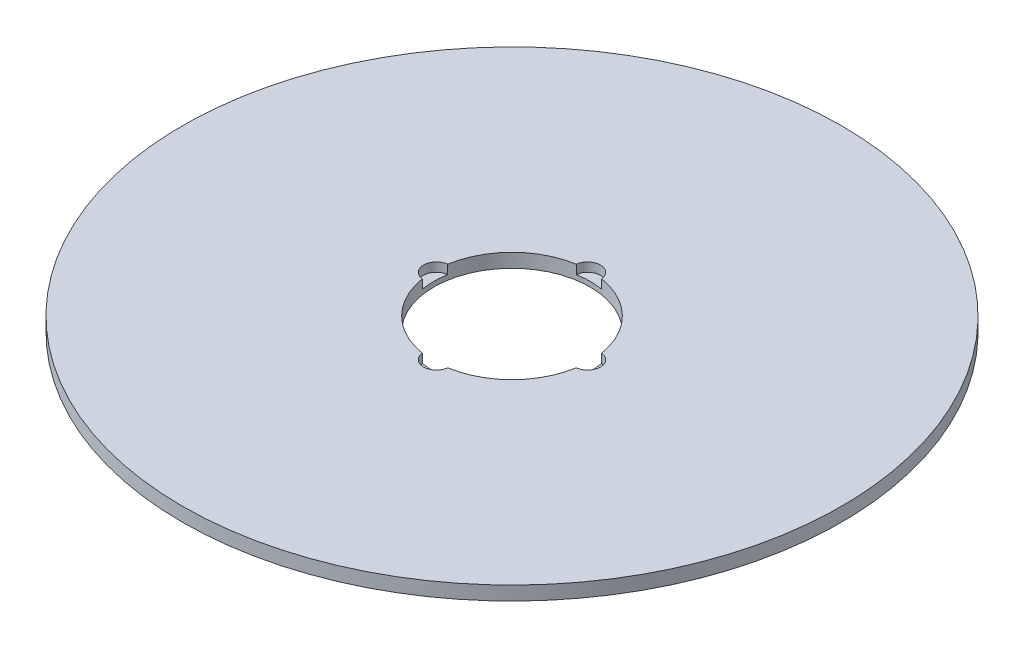
ISO-10303-21;
HEADER;
FILE_DESCRIPTION(('STEP AP214'),'2;1');
FILE_NAME('part.step','',(''),(''),'','','');
FILE_SCHEMA(('AUTOMOTIVE_DESIGN { 1 0 10303 214 1 1 1 1 }'));
ENDSEC;
DATA;
#1=APPLICATION_CONTEXT('core data for automotive mechanical design processes');
#2=APPLICATION_PROTOCOL_DEFINITION('international standard','automotive_design',2000,#1);
#3=PRODUCT_CONTEXT('',#1,'mechanical');
#4=PRODUCT('Part','Part','',(#3));
#5=PRODUCT_RELATED_PRODUCT_CATEGORY('part','',(#4));
#6=PRODUCT_DEFINITION_FORMATION('','',#4);
#7=PRODUCT_DEFINITION_CONTEXT('part definition',#1,'design');
#8=PRODUCT_DEFINITION('design','',#6,#7);
#9=PRODUCT_DEFINITION_SHAPE('','',#8);
#10=(LENGTH_UNIT() NAMED_UNIT(*) SI_UNIT(.MILLI.,.METRE.));
#11=(NAMED_UNIT(*) PLANE_ANGLE_UNIT() SI_UNIT($,.RADIAN.));
#12=(NAMED_UNIT(*) SI_UNIT($,.STERADIAN.) SOLID_ANGLE_UNIT());
#13=UNCERTAINTY_MEASURE_WITH_UNIT(LENGTH_MEASURE(1.E-05),#10,'distance_accuracy_value','');
#14=(GEOMETRIC_REPRESENTATION_CONTEXT(3) GLOBAL_UNCERTAINTY_ASSIGNED_CONTEXT((#13)) GLOBAL_UNIT_ASSIGNED_CONTEXT((#10,
#11,#12)) REPRESENTATION_CONTEXT('',''));
#15=CARTESIAN_POINT('',(0.,0.,0.));
#16=DIRECTION('',(0.,0.,1.));
#17=DIRECTION('',(1.,0.,0.));
#18=AXIS2_PLACEMENT_3D('',#15,#16,#17);
#19=CARTESIAN_POINT('',(0.,4.,0.));
#20=DIRECTION('',(0.,-1.,0.));
#21=DIRECTION('',(0.,0.,-1.));
#22=AXIS2_PLACEMENT_3D('',#19,#20,#21);
#23=CYLINDRICAL_SURFACE('',#22,95.);
#24=CARTESIAN_POINT('',(0.,4.,0.));
#25=DIRECTION('',(0.,1.,0.));
#26=DIRECTION('',(0.,0.,1.));
#27=AXIS2_PLACEMENT_3D('',#24,#25,#26);
#28=CIRCLE('',#27,95.);
#29=CARTESIAN_POINT('',(0.,4.,95.));
#30=VERTEX_POINT('',#29);
#31=EDGE_CURVE('E148',#30,#30,#28,.T.);
#32=ORIENTED_EDGE('',*,*,#31,.F.);
#33=EDGE_LOOP('',(#32));
#34=FACE_BOUND('',#33,.T.);
#35=CARTESIAN_POINT('',(0.,0.,0.));
#36=DIRECTION('',(0.,1.,0.));
#37=DIRECTION('',(0.,0.,1.));
#38=AXIS2_PLACEMENT_3D('',#35,#36,#37);
#39=CIRCLE('',#38,95.);
#40=CARTESIAN_POINT('',(0.,0.,95.));
#41=VERTEX_POINT('',#40);
#42=EDGE_CURVE('E139',#41,#41,#39,.T.);
#43=ORIENTED_EDGE('',*,*,#42,.T.);
#44=EDGE_LOOP('',(#43));
#45=FACE_BOUND('',#44,.T.);
#46=ADVANCED_FACE('F39',(#34,#45),#23,.T.);
#47=CARTESIAN_POINT('',(0.,4.,0.));
#48=DIRECTION('',(0.,1.,0.));
#49=DIRECTION('',(0.,0.,1.));
#50=AXIS2_PLACEMENT_3D('',#47,#48,#49);
#51=PLANE('',#50);
#52=CARTESIAN_POINT('',(0.,4.,21.7918346081604));
#53=DIRECTION('',(0.,1.,0.));
#54=DIRECTION('',(1.,0.,0.));
#55=AXIS2_PLACEMENT_3D('',#52,#53,#54);
#56=CIRCLE('',#55,3.68968708236115);
#57=CARTESIAN_POINT('',(-3.66713616598256,4.,22.1991466579268));
#58=VERTEX_POINT('',#57);
#59=CARTESIAN_POINT('',(3.66713616598272,4.,22.1991466579268));
#60=VERTEX_POINT('',#59);
#61=EDGE_CURVE('E175',#58,#60,#56,.T.);
#62=ORIENTED_EDGE('',*,*,#61,.F.);
#63=CARTESIAN_POINT('',(0.,4.,0.));
#64=DIRECTION('',(0.,1.,0.));
#65=DIRECTION('',(0.,0.,1.));
#66=AXIS2_PLACEMENT_3D('',#63,#64,#65);
#67=CIRCLE('',#66,22.5);
#68=CARTESIAN_POINT('',(-22.1991466579268,4.,3.66713616598264));
#69=VERTEX_POINT('',#68);
#70=EDGE_CURVE('E134',#69,#58,#67,.T.);
#71=ORIENTED_EDGE('',*,*,#70,.F.);
#72=CARTESIAN_POINT('',(-21.7918346081604,4.,0.));
#73=DIRECTION('',(0.,1.,0.));
#74=DIRECTION('',(0.,0.,1.));
#75=AXIS2_PLACEMENT_3D('',#72,#73,#74);
#76=CIRCLE('',#75,3.68968708236115);
#77=CARTESIAN_POINT('',(-22.1991466579268,4.,-3.66713616598264));
#78=VERTEX_POINT('',#77);
#79=EDGE_CURVE('E143',#78,#69,#76,.T.);
#80=ORIENTED_EDGE('',*,*,#79,.F.);
#81=CARTESIAN_POINT('',(-3.66713616598287,4.,-22.1991466579268));
#82=VERTEX_POINT('',#81);
#83=EDGE_CURVE('E123',#82,#78,#67,.T.);
#84=ORIENTED_EDGE('',*,*,#83,.F.);
#85=CARTESIAN_POINT('',(-2.28257351620644E-13,4.,-21.7918346081604));
#86=DIRECTION('',(0.,1.,0.));
#87=DIRECTION('',(-1.,0.,0.));
#88=AXIS2_PLACEMENT_3D('',#85,#86,#87);
#89=CIRCLE('',#88,3.68968708236115);
#90=CARTESIAN_POINT('',(3.66713616598241,4.,-22.1991466579268));
#91=VERTEX_POINT('',#90);
#92=EDGE_CURVE('E106',#91,#82,#89,.T.);
#93=ORIENTED_EDGE('',*,*,#92,.F.);
#94=CARTESIAN_POINT('',(22.1991466579268,4.,-3.66713616598264));
#95=VERTEX_POINT('',#94);
#96=EDGE_CURVE('E125',#95,#91,#67,.T.);
#97=ORIENTED_EDGE('',*,*,#96,.F.);
#98=CARTESIAN_POINT('',(21.7918346081604,4.,0.));
#99=DIRECTION('',(0.,1.,0.));
#100=DIRECTION('',(0.,0.,-1.));
#101=AXIS2_PLACEMENT_3D('',#98,#99,#100);
#102=CIRCLE('',#101,3.68968708236115);
#103=CARTESIAN_POINT('',(22.1991466579268,4.,3.66713616598264));
#104=VERTEX_POINT('',#103);
#105=EDGE_CURVE('E286',#104,#95,#102,.T.);
#106=ORIENTED_EDGE('',*,*,#105,.F.);
#107=EDGE_CURVE('E135',#60,#104,#67,.T.);
#108=ORIENTED_EDGE('',*,*,#107,.F.);
#109=EDGE_LOOP('',(#62,#71,#80,#84,#93,#97,#106,#108));
#110=FACE_BOUND('',#109,.T.);
#111=ORIENTED_EDGE('',*,*,#31,.T.);
#112=EDGE_LOOP('',(#111));
#113=FACE_BOUND('',#112,.T.);
#114=ADVANCED_FACE('F118',(#110,#113),#51,.T.);
#115=CARTESIAN_POINT('',(0.,0.,0.));
#116=DIRECTION('',(0.,1.,0.));
#117=DIRECTION('',(0.,0.,1.));
#118=AXIS2_PLACEMENT_3D('',#115,#116,#117);
#119=PLANE('',#118);
#120=CARTESIAN_POINT('',(0.,0.,0.));
#121=DIRECTION('',(0.,1.,0.));
#122=DIRECTION('',(0.,0.,1.));
#123=AXIS2_PLACEMENT_3D('',#120,#121,#122);
#124=CIRCLE('',#123,22.5);
#125=CARTESIAN_POINT('',(0.,0.,22.5));
#126=VERTEX_POINT('',#125);
#127=EDGE_CURVE('E136',#126,#126,#124,.T.);
#128=ORIENTED_EDGE('',*,*,#127,.T.);
#129=EDGE_LOOP('',(#128));
#130=FACE_BOUND('',#129,.T.);
#131=ORIENTED_EDGE('',*,*,#42,.F.);
#132=EDGE_LOOP('',(#131));
#133=FACE_BOUND('',#132,.T.);
#134=ADVANCED_FACE('F187',(#130,#133),#119,.F.);
#135=CARTESIAN_POINT('',(0.,4.,0.));
#136=DIRECTION('',(0.,-1.,0.));
#137=DIRECTION('',(0.,0.,-1.));
#138=AXIS2_PLACEMENT_3D('',#135,#136,#137);
#139=CYLINDRICAL_SURFACE('',#138,22.5);
#140=DIRECTION('',(0.,1.,0.));
#141=VECTOR('',#140,1.);
#142=CARTESIAN_POINT('',(-3.66713616598256,2.70690522378517,22.1991466579268));
#143=LINE('',#142,#141);
#144=CARTESIAN_POINT('',(-3.66713616598256,1.41381044757035,22.1991466579268));
#145=VERTEX_POINT('',#144);
#146=EDGE_CURVE('E11',#145,#58,#143,.T.);
#147=ORIENTED_EDGE('',*,*,#146,.F.);
#148=CARTESIAN_POINT('',(0.,1.41381044757035,0.));
#149=DIRECTION('',(0.,1.,0.));
#150=DIRECTION('',(0.,0.,1.));
#151=AXIS2_PLACEMENT_3D('',#148,#149,#150);
#152=CIRCLE('',#151,22.5);
#153=CARTESIAN_POINT('',(3.66713616598272,1.41381044757035,22.1991466579268));
#154=VERTEX_POINT('',#153);
#155=EDGE_CURVE('E170',#145,#154,#152,.T.);
#156=ORIENTED_EDGE('',*,*,#155,.T.);
#157=DIRECTION('',(0.,1.,0.));
#158=VECTOR('',#157,1.);
#159=CARTESIAN_POINT('',(3.66713616598272,2.70690522378517,22.1991466579268));
#160=LINE('',#159,#158);
#161=EDGE_CURVE('E46',#60,#154,#160,.F.);
#162=ORIENTED_EDGE('',*,*,#161,.F.);
#163=ORIENTED_EDGE('',*,*,#107,.T.);
#164=DIRECTION('',(0.,1.,0.));
#165=VECTOR('',#164,1.);
#166=CARTESIAN_POINT('',(22.1991466579268,2.70690522378517,3.66713616598264));
#167=LINE('',#166,#165);
#168=CARTESIAN_POINT('',(22.1991466579268,1.41381044757035,3.66713616598264));
#169=VERTEX_POINT('',#168);
#170=EDGE_CURVE('E164',#169,#104,#167,.T.);
#171=ORIENTED_EDGE('',*,*,#170,.F.);
#172=CARTESIAN_POINT('',(0.,1.41381044757035,0.));
#173=DIRECTION('',(0.,1.,0.));
#174=DIRECTION('',(0.,0.,1.));
#175=AXIS2_PLACEMENT_3D('',#172,#173,#174);
#176=CIRCLE('',#175,22.5);
#177=CARTESIAN_POINT('',(22.1991466579268,1.41381044757035,-3.66713616598264));
#178=VERTEX_POINT('',#177);
#179=EDGE_CURVE('E115',#169,#178,#176,.T.);
#180=ORIENTED_EDGE('',*,*,#179,.T.);
#181=DIRECTION('',(0.,1.,0.));
#182=VECTOR('',#181,1.);
#183=CARTESIAN_POINT('',(22.1991466579268,2.70690522378517,-3.66713616598264));
#184=LINE('',#183,#182);
#185=EDGE_CURVE('E131',#95,#178,#184,.F.);
#186=ORIENTED_EDGE('',*,*,#185,.F.);
#187=ORIENTED_EDGE('',*,*,#96,.T.);
#188=DIRECTION('',(0.,1.,0.));
#189=VECTOR('',#188,1.);
#190=CARTESIAN_POINT('',(3.66713616598241,2.70690522378517,-22.1991466579268));
#191=LINE('',#190,#189);
#192=CARTESIAN_POINT('',(3.66713616598241,1.41381044757035,-22.1991466579268));
#193=VERTEX_POINT('',#192);
#194=EDGE_CURVE('E105',#193,#91,#191,.T.);
#195=ORIENTED_EDGE('',*,*,#194,.F.);
#196=CARTESIAN_POINT('',(0.,1.41381044757035,0.));
#197=DIRECTION('',(0.,1.,0.));
#198=DIRECTION('',(0.,0.,1.));
#199=AXIS2_PLACEMENT_3D('',#196,#197,#198);
#200=CIRCLE('',#199,22.5);
#201=CARTESIAN_POINT('',(-3.66713616598287,1.41381044757035,-22.1991466579268));
#202=VERTEX_POINT('',#201);
#203=EDGE_CURVE('E159',#193,#202,#200,.T.);
#204=ORIENTED_EDGE('',*,*,#203,.T.);
#205=DIRECTION('',(0.,1.,0.));
#206=VECTOR('',#205,1.);
#207=CARTESIAN_POINT('',(-3.66713616598287,2.70690522378517,-22.1991466579268));
#208=LINE('',#207,#206);
#209=EDGE_CURVE('E114',#82,#202,#208,.F.);
#210=ORIENTED_EDGE('',*,*,#209,.F.);
#211=ORIENTED_EDGE('',*,*,#83,.T.);
#212=DIRECTION('',(0.,1.,0.));
#213=VECTOR('',#212,1.);
#214=CARTESIAN_POINT('',(-22.1991466579268,2.70690522378517,-3.66713616598264));
#215=LINE('',#214,#213);
#216=CARTESIAN_POINT('',(-22.1991466579268,1.41381044757035,-3.66713616598264));
#217=VERTEX_POINT('',#216);
#218=EDGE_CURVE('E160',#217,#78,#215,.T.);
#219=ORIENTED_EDGE('',*,*,#218,.F.);
#220=CARTESIAN_POINT('',(0.,1.41381044757035,0.));
#221=DIRECTION('',(0.,1.,0.));
#222=DIRECTION('',(0.,0.,1.));
#223=AXIS2_PLACEMENT_3D('',#220,#221,#222);
#224=CIRCLE('',#223,22.5);
#225=CARTESIAN_POINT('',(-22.1991466579268,1.41381044757035,3.66713616598264));
#226=VERTEX_POINT('',#225);
#227=EDGE_CURVE('E149',#217,#226,#224,.T.);
#228=ORIENTED_EDGE('',*,*,#227,.T.);
#229=DIRECTION('',(0.,1.,0.));
#230=VECTOR('',#229,1.);
#231=CARTESIAN_POINT('',(-22.1991466579268,2.70690522378517,3.66713616598264));
#232=LINE('',#231,#230);
#233=EDGE_CURVE('E152',#69,#226,#232,.F.);
#234=ORIENTED_EDGE('',*,*,#233,.F.);
#235=ORIENTED_EDGE('',*,*,#70,.T.);
#236=EDGE_LOOP('',(#147,#156,#162,#163,#171,#180,#186,#187,#195,#204,#210,#211,#219,#228,#234,#235));
#237=FACE_BOUND('',#236,.T.);
#238=ORIENTED_EDGE('',*,*,#127,.F.);
#239=EDGE_LOOP('',(#238));
#240=FACE_BOUND('',#239,.T.);
#241=ADVANCED_FACE('F126',(#237,#240),#139,.F.);
#242=CARTESIAN_POINT('',(-21.7918346081604,1.41381044757035,0.));
#243=DIRECTION('',(0.,1.,0.));
#244=DIRECTION('',(0.,0.,1.));
#245=AXIS2_PLACEMENT_3D('',#242,#243,#244);
#246=CYLINDRICAL_SURFACE('',#245,3.68968708236115);
#247=ORIENTED_EDGE('',*,*,#218,.T.);
#248=ORIENTED_EDGE('',*,*,#79,.T.);
#249=ORIENTED_EDGE('',*,*,#233,.T.);
#250=CARTESIAN_POINT('',(-21.7918346081604,1.41381044757035,0.));
#251=DIRECTION('',(0.,1.,0.));
#252=DIRECTION('',(0.,0.,1.));
#253=AXIS2_PLACEMENT_3D('',#250,#251,#252);
#254=CIRCLE('',#253,3.68968708236115);
#255=EDGE_CURVE('E144',#217,#226,#254,.T.);
#256=ORIENTED_EDGE('',*,*,#255,.F.);
#257=EDGE_LOOP('',(#247,#248,#249,#256));
#258=FACE_BOUND('',#257,.T.);
#259=ADVANCED_FACE('F200',(#258),#246,.F.);
#260=CARTESIAN_POINT('',(-21.7918346081604,1.41381044757035,0.));
#261=DIRECTION('',(0.,1.,0.));
#262=DIRECTION('',(0.,0.,1.));
#263=AXIS2_PLACEMENT_3D('',#260,#261,#262);
#264=PLANE('',#263);
#265=ORIENTED_EDGE('',*,*,#255,.T.);
#266=ORIENTED_EDGE('',*,*,#227,.F.);
#267=EDGE_LOOP('',(#265,#266));
#268=FACE_BOUND('',#267,.T.);
#269=ADVANCED_FACE('F201',(#268),#264,.T.);
#270=CARTESIAN_POINT('',(-2.28257351620644E-13,1.41381044757035,-21.7918346081604));
#271=DIRECTION('',(0.,1.,0.));
#272=DIRECTION('',(0.,0.,1.));
#273=AXIS2_PLACEMENT_3D('',#270,#271,#272);
#274=CYLINDRICAL_SURFACE('',#273,3.68968708236115);
#275=ORIENTED_EDGE('',*,*,#194,.T.);
#276=ORIENTED_EDGE('',*,*,#92,.T.);
#277=ORIENTED_EDGE('',*,*,#209,.T.);
#278=CARTESIAN_POINT('',(-2.28257351620644E-13,1.41381044757035,-21.7918346081604));
#279=DIRECTION('',(0.,1.,0.));
#280=DIRECTION('',(-1.,0.,0.));
#281=AXIS2_PLACEMENT_3D('',#278,#279,#280);
#282=CIRCLE('',#281,3.68968708236115);
#283=EDGE_CURVE('E107',#193,#202,#282,.T.);
#284=ORIENTED_EDGE('',*,*,#283,.F.);
#285=EDGE_LOOP('',(#275,#276,#277,#284));
#286=FACE_BOUND('',#285,.T.);
#287=ADVANCED_FACE('F102',(#286),#274,.F.);
#288=CARTESIAN_POINT('',(-2.28257351620644E-13,1.41381044757035,-21.7918346081604));
#289=DIRECTION('',(0.,1.,0.));
#290=DIRECTION('',(-1.,0.,0.));
#291=AXIS2_PLACEMENT_3D('',#288,#289,#290);
#292=PLANE('',#291);
#293=ORIENTED_EDGE('',*,*,#283,.T.);
#294=ORIENTED_EDGE('',*,*,#203,.F.);
#295=EDGE_LOOP('',(#293,#294));
#296=FACE_BOUND('',#295,.T.);
#297=ADVANCED_FACE('F209',(#296),#292,.T.);
#298=CARTESIAN_POINT('',(21.7918346081604,1.41381044757035,0.));
#299=DIRECTION('',(0.,1.,0.));
#300=DIRECTION('',(0.,0.,1.));
#301=AXIS2_PLACEMENT_3D('',#298,#299,#300);
#302=CYLINDRICAL_SURFACE('',#301,3.68968708236115);
#303=ORIENTED_EDGE('',*,*,#170,.T.);
#304=ORIENTED_EDGE('',*,*,#105,.T.);
#305=ORIENTED_EDGE('',*,*,#185,.T.);
#306=CARTESIAN_POINT('',(21.7918346081604,1.41381044757035,0.));
#307=DIRECTION('',(0.,1.,0.));
#308=DIRECTION('',(0.,0.,-1.));
#309=AXIS2_PLACEMENT_3D('',#306,#307,#308);
#310=CIRCLE('',#309,3.68968708236115);
#311=EDGE_CURVE('E56',#169,#178,#310,.T.);
#312=ORIENTED_EDGE('',*,*,#311,.F.);
#313=EDGE_LOOP('',(#303,#304,#305,#312));
#314=FACE_BOUND('',#313,.T.);
#315=ADVANCED_FACE('F213',(#314),#302,.F.);
#316=CARTESIAN_POINT('',(21.7918346081604,1.41381044757035,0.));
#317=DIRECTION('',(0.,1.,0.));
#318=DIRECTION('',(0.,0.,-1.));
#319=AXIS2_PLACEMENT_3D('',#316,#317,#318);
#320=PLANE('',#319);
#321=ORIENTED_EDGE('',*,*,#311,.T.);
#322=ORIENTED_EDGE('',*,*,#179,.F.);
#323=EDGE_LOOP('',(#321,#322));
#324=FACE_BOUND('',#323,.T.);
#325=ADVANCED_FACE('F179',(#324),#320,.T.);
#326=CARTESIAN_POINT('',(0.,1.41381044757035,21.7918346081604));
#327=DIRECTION('',(0.,1.,0.));
#328=DIRECTION('',(0.,0.,1.));
#329=AXIS2_PLACEMENT_3D('',#326,#327,#328);
#330=CYLINDRICAL_SURFACE('',#329,3.68968708236115);
#331=ORIENTED_EDGE('',*,*,#146,.T.);
#332=ORIENTED_EDGE('',*,*,#61,.T.);
#333=ORIENTED_EDGE('',*,*,#161,.T.);
#334=CARTESIAN_POINT('',(0.,1.41381044757035,21.7918346081604));
#335=DIRECTION('',(0.,1.,0.));
#336=DIRECTION('',(1.,0.,0.));
#337=AXIS2_PLACEMENT_3D('',#334,#335,#336);
#338=CIRCLE('',#337,3.68968708236115);
#339=EDGE_CURVE('E55',#145,#154,#338,.T.);
#340=ORIENTED_EDGE('',*,*,#339,.F.);
#341=EDGE_LOOP('',(#331,#332,#333,#340));
#342=FACE_BOUND('',#341,.T.);
#343=ADVANCED_FACE('F171',(#342),#330,.F.);
#344=CARTESIAN_POINT('',(0.,1.41381044757035,21.7918346081604));
#345=DIRECTION('',(0.,1.,0.));
#346=DIRECTION('',(1.,0.,0.));
#347=AXIS2_PLACEMENT_3D('',#344,#345,#346);
#348=PLANE('',#347);
#349=ORIENTED_EDGE('',*,*,#339,.T.);
#350=ORIENTED_EDGE('',*,*,#155,.F.);
#351=EDGE_LOOP('',(#349,#350));
#352=FACE_BOUND('',#351,.T.);
#353=ADVANCED_FACE('F173',(#352),#348,.T.);
#354=CLOSED_SHELL('',(#46,#114,#134,#241,#259,#269,#287,#297,#315,#325,#343,#353));
#355=MANIFOLD_SOLID_BREP('B2',#354);
#356=ADVANCED_BREP_SHAPE_REPRESENTATION('',(#18,#355),#14);
#357=SHAPE_DEFINITION_REPRESENTATION(#9,#356);
ENDSEC;
END-ISO-10303-21;
